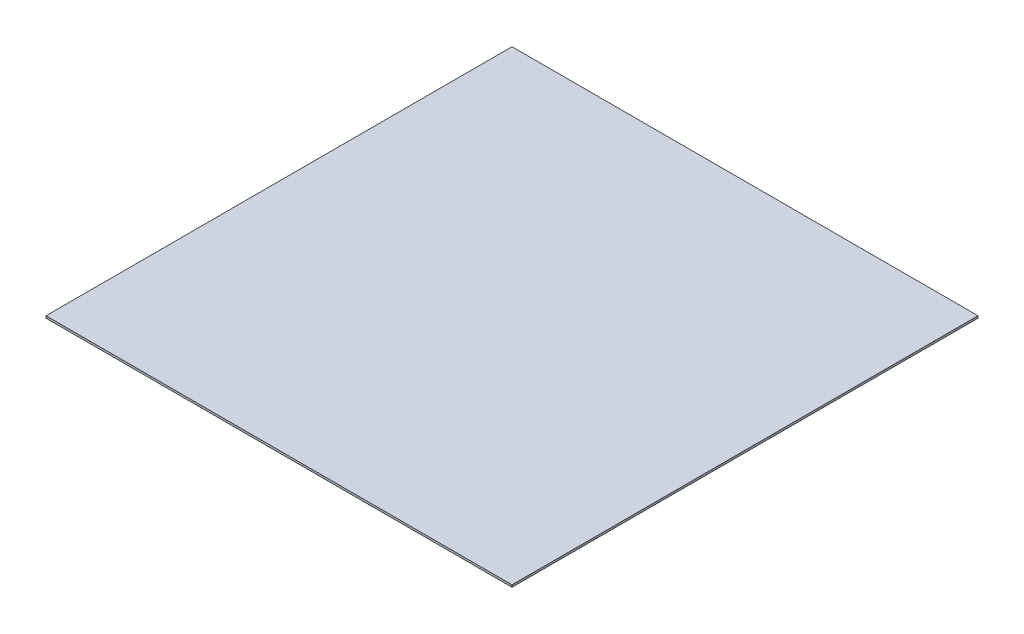
ISO-10303-21;
HEADER;
FILE_DESCRIPTION(('STEP AP214'),'2;1');
FILE_NAME('part.step','',(''),(''),'','','');
FILE_SCHEMA(('AUTOMOTIVE_DESIGN { 1 0 10303 214 1 1 1 1 }'));
ENDSEC;
DATA;
#1=APPLICATION_CONTEXT('core data for automotive mechanical design processes');
#2=APPLICATION_PROTOCOL_DEFINITION('international standard','automotive_design',2000,#1);
#3=PRODUCT_CONTEXT('',#1,'mechanical');
#4=PRODUCT('Part','Part','',(#3));
#5=PRODUCT_RELATED_PRODUCT_CATEGORY('part','',(#4));
#6=PRODUCT_DEFINITION_FORMATION('','',#4);
#7=PRODUCT_DEFINITION_CONTEXT('part definition',#1,'design');
#8=PRODUCT_DEFINITION('design','',#6,#7);
#9=PRODUCT_DEFINITION_SHAPE('','',#8);
#10=(LENGTH_UNIT() NAMED_UNIT(*) SI_UNIT(.MILLI.,.METRE.));
#11=(NAMED_UNIT(*) PLANE_ANGLE_UNIT() SI_UNIT($,.RADIAN.));
#12=(NAMED_UNIT(*) SI_UNIT($,.STERADIAN.) SOLID_ANGLE_UNIT());
#13=UNCERTAINTY_MEASURE_WITH_UNIT(LENGTH_MEASURE(1.E-05),#10,'distance_accuracy_value','');
#14=(GEOMETRIC_REPRESENTATION_CONTEXT(3) GLOBAL_UNCERTAINTY_ASSIGNED_CONTEXT((#13)) GLOBAL_UNIT_ASSIGNED_CONTEXT((#10,
#11,#12)) REPRESENTATION_CONTEXT('',''));
#15=CARTESIAN_POINT('',(0.,0.,0.));
#16=DIRECTION('',(0.,0.,1.));
#17=DIRECTION('',(1.,0.,0.));
#18=AXIS2_PLACEMENT_3D('',#15,#16,#17);
#19=CARTESIAN_POINT('',(0.,2.54,0.));
#20=DIRECTION('',(1.,0.,0.));
#21=DIRECTION('',(0.,0.,-1.));
#22=AXIS2_PLACEMENT_3D('',#19,#20,#21);
#23=PLANE('',#22);
#24=DIRECTION('',(0.,0.,1.));
#25=VECTOR('',#24,1.);
#26=CARTESIAN_POINT('',(0.,0.,0.));
#27=LINE('',#26,#25);
#28=CARTESIAN_POINT('',(0.,0.,0.));
#29=VERTEX_POINT('',#28);
#30=CARTESIAN_POINT('',(0.,0.,558.8));
#31=VERTEX_POINT('',#30);
#32=EDGE_CURVE('E96',#29,#31,#27,.T.);
#33=ORIENTED_EDGE('',*,*,#32,.T.);
#34=DIRECTION('',(0.,-1.,0.));
#35=VECTOR('',#34,1.);
#36=CARTESIAN_POINT('',(0.,2.54,558.8));
#37=LINE('',#36,#35);
#38=CARTESIAN_POINT('',(0.,2.54,558.8));
#39=VERTEX_POINT('',#38);
#40=EDGE_CURVE('E11',#39,#31,#37,.T.);
#41=ORIENTED_EDGE('',*,*,#40,.F.);
#42=DIRECTION('',(0.,0.,1.));
#43=VECTOR('',#42,1.);
#44=CARTESIAN_POINT('',(0.,2.54,0.));
#45=LINE('',#44,#43);
#46=CARTESIAN_POINT('',(0.,2.54,0.));
#47=VERTEX_POINT('',#46);
#48=EDGE_CURVE('E84',#47,#39,#45,.T.);
#49=ORIENTED_EDGE('',*,*,#48,.F.);
#50=DIRECTION('',(0.,-1.,0.));
#51=VECTOR('',#50,1.);
#52=CARTESIAN_POINT('',(0.,2.54,0.));
#53=LINE('',#52,#51);
#54=EDGE_CURVE('E92',#47,#29,#53,.T.);
#55=ORIENTED_EDGE('',*,*,#54,.T.);
#56=EDGE_LOOP('',(#33,#41,#49,#55));
#57=FACE_BOUND('',#56,.T.);
#58=ADVANCED_FACE('F33',(#57),#23,.F.);
#59=CARTESIAN_POINT('',(0.,2.54,558.8));
#60=DIRECTION('',(0.,0.,-1.));
#61=DIRECTION('',(-1.,0.,0.));
#62=AXIS2_PLACEMENT_3D('',#59,#60,#61);
#63=PLANE('',#62);
#64=DIRECTION('',(1.,0.,0.));
#65=VECTOR('',#64,1.);
#66=CARTESIAN_POINT('',(0.,0.,558.8));
#67=LINE('',#66,#65);
#68=CARTESIAN_POINT('',(558.8,0.,558.8));
#69=VERTEX_POINT('',#68);
#70=EDGE_CURVE('E88',#31,#69,#67,.T.);
#71=ORIENTED_EDGE('',*,*,#70,.T.);
#72=DIRECTION('',(0.,-1.,0.));
#73=VECTOR('',#72,1.);
#74=CARTESIAN_POINT('',(558.8,2.54,558.8));
#75=LINE('',#74,#73);
#76=CARTESIAN_POINT('',(558.8,2.54,558.8));
#77=VERTEX_POINT('',#76);
#78=EDGE_CURVE('E41',#77,#69,#75,.T.);
#79=ORIENTED_EDGE('',*,*,#78,.F.);
#80=DIRECTION('',(1.,0.,0.));
#81=VECTOR('',#80,1.);
#82=CARTESIAN_POINT('',(0.,2.54,558.8));
#83=LINE('',#82,#81);
#84=EDGE_CURVE('E79',#39,#77,#83,.T.);
#85=ORIENTED_EDGE('',*,*,#84,.F.);
#86=ORIENTED_EDGE('',*,*,#40,.T.);
#87=EDGE_LOOP('',(#71,#79,#85,#86));
#88=FACE_BOUND('',#87,.T.);
#89=ADVANCED_FACE('F87',(#88),#63,.F.);
#90=CARTESIAN_POINT('',(558.8,2.54,0.));
#91=DIRECTION('',(-1.,0.,0.));
#92=DIRECTION('',(0.,0.,1.));
#93=AXIS2_PLACEMENT_3D('',#90,#91,#92);
#94=PLANE('',#93);
#95=DIRECTION('',(0.,0.,-1.));
#96=VECTOR('',#95,1.);
#97=CARTESIAN_POINT('',(558.8,0.,0.));
#98=LINE('',#97,#96);
#99=CARTESIAN_POINT('',(558.8,0.,0.));
#100=VERTEX_POINT('',#99);
#101=EDGE_CURVE('E66',#69,#100,#98,.T.);
#102=ORIENTED_EDGE('',*,*,#101,.T.);
#103=DIRECTION('',(0.,-1.,0.));
#104=VECTOR('',#103,1.);
#105=CARTESIAN_POINT('',(558.8,2.54,0.));
#106=LINE('',#105,#104);
#107=CARTESIAN_POINT('',(558.8,2.54,0.));
#108=VERTEX_POINT('',#107);
#109=EDGE_CURVE('E89',#108,#100,#106,.T.);
#110=ORIENTED_EDGE('',*,*,#109,.F.);
#111=DIRECTION('',(0.,0.,-1.));
#112=VECTOR('',#111,1.);
#113=CARTESIAN_POINT('',(558.8,2.54,0.));
#114=LINE('',#113,#112);
#115=EDGE_CURVE('E82',#77,#108,#114,.T.);
#116=ORIENTED_EDGE('',*,*,#115,.F.);
#117=ORIENTED_EDGE('',*,*,#78,.T.);
#118=EDGE_LOOP('',(#102,#110,#116,#117));
#119=FACE_BOUND('',#118,.T.);
#120=ADVANCED_FACE('F90',(#119),#94,.F.);
#121=CARTESIAN_POINT('',(0.,2.54,0.));
#122=DIRECTION('',(0.,0.,1.));
#123=DIRECTION('',(1.,0.,0.));
#124=AXIS2_PLACEMENT_3D('',#121,#122,#123);
#125=PLANE('',#124);
#126=DIRECTION('',(-1.,0.,0.));
#127=VECTOR('',#126,1.);
#128=CARTESIAN_POINT('',(0.,0.,0.));
#129=LINE('',#128,#127);
#130=EDGE_CURVE('E72',#100,#29,#129,.T.);
#131=ORIENTED_EDGE('',*,*,#130,.T.);
#132=ORIENTED_EDGE('',*,*,#54,.F.);
#133=DIRECTION('',(-1.,0.,0.));
#134=VECTOR('',#133,1.);
#135=CARTESIAN_POINT('',(0.,2.54,0.));
#136=LINE('',#135,#134);
#137=EDGE_CURVE('E49',#108,#47,#136,.T.);
#138=ORIENTED_EDGE('',*,*,#137,.F.);
#139=ORIENTED_EDGE('',*,*,#109,.T.);
#140=EDGE_LOOP('',(#131,#132,#138,#139));
#141=FACE_BOUND('',#140,.T.);
#142=ADVANCED_FACE('F103',(#141),#125,.F.);
#143=CARTESIAN_POINT('',(0.,2.54,0.));
#144=DIRECTION('',(0.,1.,0.));
#145=DIRECTION('',(0.,0.,1.));
#146=AXIS2_PLACEMENT_3D('',#143,#144,#145);
#147=PLANE('',#146);
#148=ORIENTED_EDGE('',*,*,#48,.T.);
#149=ORIENTED_EDGE('',*,*,#84,.T.);
#150=ORIENTED_EDGE('',*,*,#115,.T.);
#151=ORIENTED_EDGE('',*,*,#137,.T.);
#152=EDGE_LOOP('',(#148,#149,#150,#151));
#153=FACE_BOUND('',#152,.T.);
#154=ADVANCED_FACE('F80',(#153),#147,.T.);
#155=CARTESIAN_POINT('',(0.,0.,0.));
#156=DIRECTION('',(0.,1.,0.));
#157=DIRECTION('',(0.,0.,1.));
#158=AXIS2_PLACEMENT_3D('',#155,#156,#157);
#159=PLANE('',#158);
#160=ORIENTED_EDGE('',*,*,#32,.F.);
#161=ORIENTED_EDGE('',*,*,#130,.F.);
#162=ORIENTED_EDGE('',*,*,#101,.F.);
#163=ORIENTED_EDGE('',*,*,#70,.F.);
#164=EDGE_LOOP('',(#160,#161,#162,#163));
#165=FACE_BOUND('',#164,.T.);
#166=ADVANCED_FACE('F106',(#165),#159,.F.);
#167=CLOSED_SHELL('',(#58,#89,#120,#142,#154,#166));
#168=MANIFOLD_SOLID_BREP('B2',#167);
#169=ADVANCED_BREP_SHAPE_REPRESENTATION('',(#18,#168),#14);
#170=SHAPE_DEFINITION_REPRESENTATION(#9,#169);
ENDSEC;
END-ISO-10303-21;
